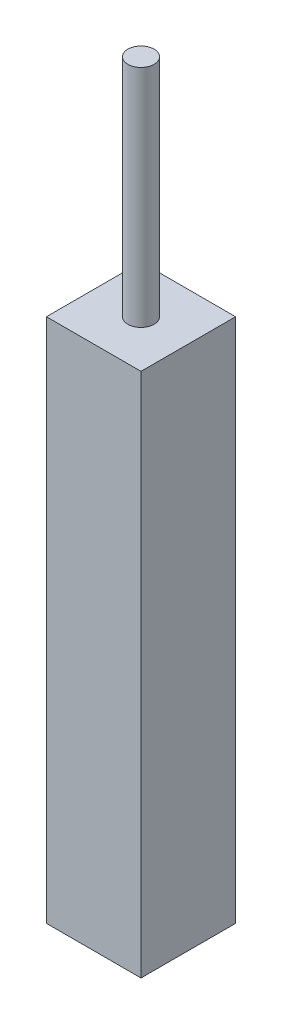
ISO-10303-21;
HEADER;
FILE_DESCRIPTION(('STEP AP214'),'2;1');
FILE_NAME('part.step','',(''),(''),'','','');
FILE_SCHEMA(('AUTOMOTIVE_DESIGN { 1 0 10303 214 1 1 1 1 }'));
ENDSEC;
DATA;
#1=APPLICATION_CONTEXT('core data for automotive mechanical design processes');
#2=APPLICATION_PROTOCOL_DEFINITION('international standard','automotive_design',2000,#1);
#3=PRODUCT_CONTEXT('',#1,'mechanical');
#4=PRODUCT('Part','Part','',(#3));
#5=PRODUCT_RELATED_PRODUCT_CATEGORY('part','',(#4));
#6=PRODUCT_DEFINITION_FORMATION('','',#4);
#7=PRODUCT_DEFINITION_CONTEXT('part definition',#1,'design');
#8=PRODUCT_DEFINITION('design','',#6,#7);
#9=PRODUCT_DEFINITION_SHAPE('','',#8);
#10=(LENGTH_UNIT() NAMED_UNIT(*) SI_UNIT(.MILLI.,.METRE.));
#11=(NAMED_UNIT(*) PLANE_ANGLE_UNIT() SI_UNIT($,.RADIAN.));
#12=(NAMED_UNIT(*) SI_UNIT($,.STERADIAN.) SOLID_ANGLE_UNIT());
#13=UNCERTAINTY_MEASURE_WITH_UNIT(LENGTH_MEASURE(1.E-05),#10,'distance_accuracy_value','');
#14=(GEOMETRIC_REPRESENTATION_CONTEXT(3) GLOBAL_UNCERTAINTY_ASSIGNED_CONTEXT((#13)) GLOBAL_UNIT_ASSIGNED_CONTEXT((#10,
#11,#12)) REPRESENTATION_CONTEXT('',''));
#15=CARTESIAN_POINT('',(0.,0.,0.));
#16=DIRECTION('',(0.,0.,1.));
#17=DIRECTION('',(1.,0.,0.));
#18=AXIS2_PLACEMENT_3D('',#15,#16,#17);
#19=CARTESIAN_POINT('',(0.,14.,0.));
#20=DIRECTION('',(1.,0.,0.));
#21=DIRECTION('',(0.,0.,-1.));
#22=AXIS2_PLACEMENT_3D('',#19,#20,#21);
#23=PLANE('',#22);
#24=DIRECTION('',(0.,0.,1.));
#25=VECTOR('',#24,1.);
#26=CARTESIAN_POINT('',(0.,0.,0.));
#27=LINE('',#26,#25);
#28=CARTESIAN_POINT('',(0.,0.,-2.52));
#29=VERTEX_POINT('',#28);
#30=CARTESIAN_POINT('',(0.,0.,0.));
#31=VERTEX_POINT('',#30);
#32=EDGE_CURVE('E110',#29,#31,#27,.T.);
#33=ORIENTED_EDGE('',*,*,#32,.T.);
#34=DIRECTION('',(0.,-1.,0.));
#35=VECTOR('',#34,1.);
#36=CARTESIAN_POINT('',(0.,14.,0.));
#37=LINE('',#36,#35);
#38=CARTESIAN_POINT('',(0.,14.,0.));
#39=VERTEX_POINT('',#38);
#40=EDGE_CURVE('E42',#39,#31,#37,.T.);
#41=ORIENTED_EDGE('',*,*,#40,.F.);
#42=DIRECTION('',(0.,0.,1.));
#43=VECTOR('',#42,1.);
#44=CARTESIAN_POINT('',(0.,14.,0.));
#45=LINE('',#44,#43);
#46=CARTESIAN_POINT('',(0.,14.,-2.52));
#47=VERTEX_POINT('',#46);
#48=EDGE_CURVE('E93',#47,#39,#45,.T.);
#49=ORIENTED_EDGE('',*,*,#48,.F.);
#50=DIRECTION('',(0.,-1.,0.));
#51=VECTOR('',#50,1.);
#52=CARTESIAN_POINT('',(0.,14.,-2.52));
#53=LINE('',#52,#51);
#54=EDGE_CURVE('E106',#47,#29,#53,.T.);
#55=ORIENTED_EDGE('',*,*,#54,.T.);
#56=EDGE_LOOP('',(#33,#41,#49,#55));
#57=FACE_BOUND('',#56,.T.);
#58=ADVANCED_FACE('F39',(#57),#23,.F.);
#59=CARTESIAN_POINT('',(0.,14.,0.));
#60=DIRECTION('',(0.,0.,-1.));
#61=DIRECTION('',(-1.,0.,0.));
#62=AXIS2_PLACEMENT_3D('',#59,#60,#61);
#63=PLANE('',#62);
#64=DIRECTION('',(1.,0.,0.));
#65=VECTOR('',#64,1.);
#66=CARTESIAN_POINT('',(0.,0.,0.));
#67=LINE('',#66,#65);
#68=CARTESIAN_POINT('',(2.52,0.,0.));
#69=VERTEX_POINT('',#68);
#70=EDGE_CURVE('E99',#31,#69,#67,.T.);
#71=ORIENTED_EDGE('',*,*,#70,.T.);
#72=DIRECTION('',(0.,-1.,0.));
#73=VECTOR('',#72,1.);
#74=CARTESIAN_POINT('',(2.52,14.,0.));
#75=LINE('',#74,#73);
#76=CARTESIAN_POINT('',(2.52,14.,0.));
#77=VERTEX_POINT('',#76);
#78=EDGE_CURVE('E97',#77,#69,#75,.T.);
#79=ORIENTED_EDGE('',*,*,#78,.F.);
#80=DIRECTION('',(1.,0.,0.));
#81=VECTOR('',#80,1.);
#82=CARTESIAN_POINT('',(0.,14.,0.));
#83=LINE('',#82,#81);
#84=EDGE_CURVE('E88',#39,#77,#83,.T.);
#85=ORIENTED_EDGE('',*,*,#84,.F.);
#86=ORIENTED_EDGE('',*,*,#40,.T.);
#87=EDGE_LOOP('',(#71,#79,#85,#86));
#88=FACE_BOUND('',#87,.T.);
#89=ADVANCED_FACE('F98',(#88),#63,.F.);
#90=CARTESIAN_POINT('',(2.52,14.,0.));
#91=DIRECTION('',(-1.,0.,0.));
#92=DIRECTION('',(0.,0.,1.));
#93=AXIS2_PLACEMENT_3D('',#90,#91,#92);
#94=PLANE('',#93);
#95=DIRECTION('',(0.,0.,-1.));
#96=VECTOR('',#95,1.);
#97=CARTESIAN_POINT('',(2.52,0.,0.));
#98=LINE('',#97,#96);
#99=CARTESIAN_POINT('',(2.52,0.,-2.52));
#100=VERTEX_POINT('',#99);
#101=EDGE_CURVE('E74',#69,#100,#98,.T.);
#102=ORIENTED_EDGE('',*,*,#101,.T.);
#103=DIRECTION('',(0.,-1.,0.));
#104=VECTOR('',#103,1.);
#105=CARTESIAN_POINT('',(2.52,14.,-2.52));
#106=LINE('',#105,#104);
#107=CARTESIAN_POINT('',(2.52,14.,-2.52));
#108=VERTEX_POINT('',#107);
#109=EDGE_CURVE('E101',#108,#100,#106,.T.);
#110=ORIENTED_EDGE('',*,*,#109,.F.);
#111=DIRECTION('',(0.,0.,-1.));
#112=VECTOR('',#111,1.);
#113=CARTESIAN_POINT('',(2.52,14.,0.));
#114=LINE('',#113,#112);
#115=EDGE_CURVE('E91',#77,#108,#114,.T.);
#116=ORIENTED_EDGE('',*,*,#115,.F.);
#117=ORIENTED_EDGE('',*,*,#78,.T.);
#118=EDGE_LOOP('',(#102,#110,#116,#117));
#119=FACE_BOUND('',#118,.T.);
#120=ADVANCED_FACE('F102',(#119),#94,.F.);
#121=CARTESIAN_POINT('',(0.,14.,-2.52));
#122=DIRECTION('',(0.,0.,1.));
#123=DIRECTION('',(1.,0.,0.));
#124=AXIS2_PLACEMENT_3D('',#121,#122,#123);
#125=PLANE('',#124);
#126=DIRECTION('',(-1.,0.,0.));
#127=VECTOR('',#126,1.);
#128=CARTESIAN_POINT('',(0.,0.,-2.52));
#129=LINE('',#128,#127);
#130=EDGE_CURVE('E80',#100,#29,#129,.T.);
#131=ORIENTED_EDGE('',*,*,#130,.T.);
#132=ORIENTED_EDGE('',*,*,#54,.F.);
#133=DIRECTION('',(-1.,0.,0.));
#134=VECTOR('',#133,1.);
#135=CARTESIAN_POINT('',(0.,14.,-2.52));
#136=LINE('',#135,#134);
#137=EDGE_CURVE('E57',#108,#47,#136,.T.);
#138=ORIENTED_EDGE('',*,*,#137,.F.);
#139=ORIENTED_EDGE('',*,*,#109,.T.);
#140=EDGE_LOOP('',(#131,#132,#138,#139));
#141=FACE_BOUND('',#140,.T.);
#142=ADVANCED_FACE('F124',(#141),#125,.F.);
#143=CARTESIAN_POINT('',(0.,14.,0.));
#144=DIRECTION('',(0.,-1.,0.));
#145=DIRECTION('',(0.,0.,-1.));
#146=AXIS2_PLACEMENT_3D('',#143,#144,#145);
#147=PLANE('',#146);
#148=CARTESIAN_POINT('',(1.26,14.,-1.26));
#149=DIRECTION('',(0.,1.,0.));
#150=DIRECTION('',(0.,0.,1.));
#151=AXIS2_PLACEMENT_3D('',#148,#149,#150);
#152=CIRCLE('',#151,0.35);
#153=CARTESIAN_POINT('',(1.26,14.,-0.91));
#154=VERTEX_POINT('',#153);
#155=EDGE_CURVE('E11',#154,#154,#152,.T.);
#156=ORIENTED_EDGE('',*,*,#155,.F.);
#157=EDGE_LOOP('',(#156));
#158=FACE_BOUND('',#157,.T.);
#159=ORIENTED_EDGE('',*,*,#48,.T.);
#160=ORIENTED_EDGE('',*,*,#84,.T.);
#161=ORIENTED_EDGE('',*,*,#115,.T.);
#162=ORIENTED_EDGE('',*,*,#137,.T.);
#163=EDGE_LOOP('',(#159,#160,#161,#162));
#164=FACE_BOUND('',#163,.T.);
#165=ADVANCED_FACE('F89',(#158,#164),#147,.F.);
#166=CARTESIAN_POINT('',(0.,0.,0.));
#167=DIRECTION('',(0.,-1.,0.));
#168=DIRECTION('',(0.,0.,-1.));
#169=AXIS2_PLACEMENT_3D('',#166,#167,#168);
#170=PLANE('',#169);
#171=ORIENTED_EDGE('',*,*,#32,.F.);
#172=ORIENTED_EDGE('',*,*,#130,.F.);
#173=ORIENTED_EDGE('',*,*,#101,.F.);
#174=ORIENTED_EDGE('',*,*,#70,.F.);
#175=EDGE_LOOP('',(#171,#172,#173,#174));
#176=FACE_BOUND('',#175,.T.);
#177=ADVANCED_FACE('F127',(#176),#170,.T.);
#178=CARTESIAN_POINT('',(1.26,20.,-1.26));
#179=DIRECTION('',(0.,-1.,0.));
#180=DIRECTION('',(0.,0.,-1.));
#181=AXIS2_PLACEMENT_3D('',#178,#179,#180);
#182=CYLINDRICAL_SURFACE('',#181,0.35);
#183=CARTESIAN_POINT('',(1.26,20.,-1.26));
#184=DIRECTION('',(0.,1.,0.));
#185=DIRECTION('',(0.,0.,1.));
#186=AXIS2_PLACEMENT_3D('',#183,#184,#185);
#187=CIRCLE('',#186,0.35);
#188=CARTESIAN_POINT('',(1.26,20.,-0.91));
#189=VERTEX_POINT('',#188);
#190=EDGE_CURVE('E114',#189,#189,#187,.T.);
#191=ORIENTED_EDGE('',*,*,#190,.F.);
#192=EDGE_LOOP('',(#191));
#193=FACE_BOUND('',#192,.T.);
#194=ORIENTED_EDGE('',*,*,#155,.T.);
#195=EDGE_LOOP('',(#194));
#196=FACE_BOUND('',#195,.T.);
#197=ADVANCED_FACE('F137',(#193,#196),#182,.T.);
#198=CARTESIAN_POINT('',(1.26,20.,-1.26));
#199=DIRECTION('',(0.,1.,0.));
#200=DIRECTION('',(0.,0.,1.));
#201=AXIS2_PLACEMENT_3D('',#198,#199,#200);
#202=PLANE('',#201);
#203=ORIENTED_EDGE('',*,*,#190,.T.);
#204=EDGE_LOOP('',(#203));
#205=FACE_BOUND('',#204,.T.);
#206=ADVANCED_FACE('F135',(#205),#202,.T.);
#207=CLOSED_SHELL('',(#58,#89,#120,#142,#165,#177,#197,#206));
#208=MANIFOLD_SOLID_BREP('B2',#207);
#209=ADVANCED_BREP_SHAPE_REPRESENTATION('',(#18,#208),#14);
#210=SHAPE_DEFINITION_REPRESENTATION(#9,#209);
ENDSEC;
END-ISO-10303-21;
